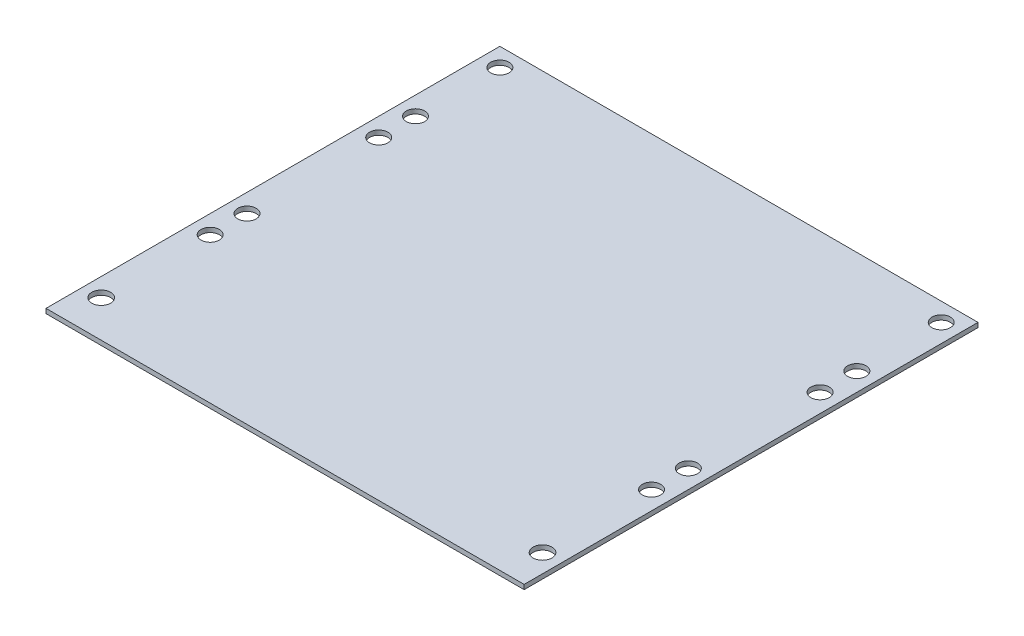
ISO-10303-21;
HEADER;
FILE_DESCRIPTION(('STEP AP214'),'2;1');
FILE_NAME('part.step','',(''),(''),'','','');
FILE_SCHEMA(('AUTOMOTIVE_DESIGN { 1 0 10303 214 1 1 1 1 }'));
ENDSEC;
DATA;
#1=APPLICATION_CONTEXT('core data for automotive mechanical design processes');
#2=APPLICATION_PROTOCOL_DEFINITION('international standard','automotive_design',2000,#1);
#3=PRODUCT_CONTEXT('',#1,'mechanical');
#4=PRODUCT('Part','Part','',(#3));
#5=PRODUCT_RELATED_PRODUCT_CATEGORY('part','',(#4));
#6=PRODUCT_DEFINITION_FORMATION('','',#4);
#7=PRODUCT_DEFINITION_CONTEXT('part definition',#1,'design');
#8=PRODUCT_DEFINITION('design','',#6,#7);
#9=PRODUCT_DEFINITION_SHAPE('','',#8);
#10=(LENGTH_UNIT() NAMED_UNIT(*) SI_UNIT(.MILLI.,.METRE.));
#11=(NAMED_UNIT(*) PLANE_ANGLE_UNIT() SI_UNIT($,.RADIAN.));
#12=(NAMED_UNIT(*) SI_UNIT($,.STERADIAN.) SOLID_ANGLE_UNIT());
#13=UNCERTAINTY_MEASURE_WITH_UNIT(LENGTH_MEASURE(1.E-05),#10,'distance_accuracy_value','');
#14=(GEOMETRIC_REPRESENTATION_CONTEXT(3) GLOBAL_UNCERTAINTY_ASSIGNED_CONTEXT((#13)) GLOBAL_UNIT_ASSIGNED_CONTEXT((#10,
#11,#12)) REPRESENTATION_CONTEXT('',''));
#15=CARTESIAN_POINT('',(0.,0.,0.));
#16=DIRECTION('',(0.,0.,1.));
#17=DIRECTION('',(1.,0.,0.));
#18=AXIS2_PLACEMENT_3D('',#15,#16,#17);
#19=CARTESIAN_POINT('',(0.,1.5875,0.));
#20=DIRECTION('',(0.,-1.,0.));
#21=DIRECTION('',(0.,0.,-1.));
#22=AXIS2_PLACEMENT_3D('',#19,#20,#21);
#23=PLANE('',#22);
#24=DIRECTION('',(0.,0.,1.));
#25=VECTOR('',#24,1.);
#26=CARTESIAN_POINT('',(0.,1.5875,0.));
#27=LINE('',#26,#25);
#28=CARTESIAN_POINT('',(0.,1.5875,-156.718));
#29=VERTEX_POINT('',#28);
#30=CARTESIAN_POINT('',(0.,1.5875,0.));
#31=VERTEX_POINT('',#30);
#32=EDGE_CURVE('E92',#29,#31,#27,.T.);
#33=ORIENTED_EDGE('',*,*,#32,.T.);
#34=DIRECTION('',(1.,0.,0.));
#35=VECTOR('',#34,1.);
#36=CARTESIAN_POINT('',(0.,1.5875,0.));
#37=LINE('',#36,#35);
#38=CARTESIAN_POINT('',(165.1,1.5875,0.));
#39=VERTEX_POINT('',#38);
#40=EDGE_CURVE('E87',#31,#39,#37,.T.);
#41=ORIENTED_EDGE('',*,*,#40,.T.);
#42=DIRECTION('',(0.,0.,-1.));
#43=VECTOR('',#42,1.);
#44=CARTESIAN_POINT('',(165.1,1.5875,0.));
#45=LINE('',#44,#43);
#46=CARTESIAN_POINT('',(165.1,1.5875,-156.718));
#47=VERTEX_POINT('',#46);
#48=EDGE_CURVE('E90',#39,#47,#45,.T.);
#49=ORIENTED_EDGE('',*,*,#48,.T.);
#50=DIRECTION('',(-1.,0.,0.));
#51=VECTOR('',#50,1.);
#52=CARTESIAN_POINT('',(0.,1.5875,-156.718));
#53=LINE('',#52,#51);
#54=EDGE_CURVE('E57',#47,#29,#53,.T.);
#55=ORIENTED_EDGE('',*,*,#54,.T.);
#56=EDGE_LOOP('',(#33,#41,#49,#55));
#57=FACE_BOUND('',#56,.T.);
#58=CARTESIAN_POINT('',(6.35,1.5875,-12.7));
#59=DIRECTION('',(0.,1.,0.));
#60=DIRECTION('',(0.,0.,1.));
#61=AXIS2_PLACEMENT_3D('',#58,#59,#60);
#62=CIRCLE('',#61,3.2639);
#63=CARTESIAN_POINT('',(6.35,1.5875,-9.4361));
#64=VERTEX_POINT('',#63);
#65=EDGE_CURVE('E112',#64,#64,#62,.T.);
#66=ORIENTED_EDGE('',*,*,#65,.F.);
#67=EDGE_LOOP('',(#66));
#68=FACE_BOUND('',#67,.T.);
#69=CARTESIAN_POINT('',(6.35,1.5875,-121.2365567009));
#70=DIRECTION('',(0.,1.,0.));
#71=DIRECTION('',(0.,0.,1.));
#72=AXIS2_PLACEMENT_3D('',#69,#70,#71);
#73=CIRCLE('',#72,3.175);
#74=CARTESIAN_POINT('',(6.35,1.5875,-118.0615567009));
#75=VERTEX_POINT('',#74);
#76=EDGE_CURVE('E134',#75,#75,#73,.T.);
#77=ORIENTED_EDGE('',*,*,#76,.F.);
#78=EDGE_LOOP('',(#77));
#79=FACE_BOUND('',#78,.T.);
#80=CARTESIAN_POINT('',(6.35,1.5875,-108.5365567009));
#81=DIRECTION('',(0.,1.,0.));
#82=DIRECTION('',(0.,0.,1.));
#83=AXIS2_PLACEMENT_3D('',#80,#81,#82);
#84=CIRCLE('',#83,3.175);
#85=CARTESIAN_POINT('',(6.35,1.5875,-105.3615567009));
#86=VERTEX_POINT('',#85);
#87=EDGE_CURVE('E142',#86,#86,#84,.T.);
#88=ORIENTED_EDGE('',*,*,#87,.F.);
#89=EDGE_LOOP('',(#88));
#90=FACE_BOUND('',#89,.T.);
#91=CARTESIAN_POINT('',(6.35,1.5875,-63.046989690376));
#92=DIRECTION('',(0.,1.,0.));
#93=DIRECTION('',(0.,0.,1.));
#94=AXIS2_PLACEMENT_3D('',#91,#92,#93);
#95=CIRCLE('',#94,3.175);
#96=CARTESIAN_POINT('',(6.35,1.5875,-59.871989690376));
#97=VERTEX_POINT('',#96);
#98=EDGE_CURVE('E150',#97,#97,#95,.T.);
#99=ORIENTED_EDGE('',*,*,#98,.F.);
#100=EDGE_LOOP('',(#99));
#101=FACE_BOUND('',#100,.T.);
#102=CARTESIAN_POINT('',(6.35,1.5875,-150.368));
#103=DIRECTION('',(0.,1.,0.));
#104=DIRECTION('',(0.,0.,1.));
#105=AXIS2_PLACEMENT_3D('',#102,#103,#104);
#106=CIRCLE('',#105,3.175);
#107=CARTESIAN_POINT('',(6.35,1.5875,-147.193));
#108=VERTEX_POINT('',#107);
#109=EDGE_CURVE('E158',#108,#108,#106,.T.);
#110=ORIENTED_EDGE('',*,*,#109,.F.);
#111=EDGE_LOOP('',(#110));
#112=FACE_BOUND('',#111,.T.);
#113=CARTESIAN_POINT('',(158.75,1.5875,-12.7));
#114=DIRECTION('',(0.,1.,0.));
#115=DIRECTION('',(0.,0.,-1.));
#116=AXIS2_PLACEMENT_3D('',#113,#114,#115);
#117=CIRCLE('',#116,3.26390000000001);
#118=CARTESIAN_POINT('',(158.75,1.5875,-15.9639));
#119=VERTEX_POINT('',#118);
#120=EDGE_CURVE('E166',#119,#119,#117,.T.);
#121=ORIENTED_EDGE('',*,*,#120,.F.);
#122=EDGE_LOOP('',(#121));
#123=FACE_BOUND('',#122,.T.);
#124=CARTESIAN_POINT('',(6.35,1.5875,-50.346989690376));
#125=DIRECTION('',(0.,1.,0.));
#126=DIRECTION('',(0.,0.,1.));
#127=AXIS2_PLACEMENT_3D('',#124,#125,#126);
#128=CIRCLE('',#127,3.175);
#129=CARTESIAN_POINT('',(6.35,1.5875,-47.171989690376));
#130=VERTEX_POINT('',#129);
#131=EDGE_CURVE('E174',#130,#130,#128,.T.);
#132=ORIENTED_EDGE('',*,*,#131,.F.);
#133=EDGE_LOOP('',(#132));
#134=FACE_BOUND('',#133,.T.);
#135=CARTESIAN_POINT('',(158.75,1.5875,-50.346989690376));
#136=DIRECTION('',(0.,1.,0.));
#137=DIRECTION('',(0.,0.,-1.));
#138=AXIS2_PLACEMENT_3D('',#135,#136,#137);
#139=CIRCLE('',#138,3.17500000000002);
#140=CARTESIAN_POINT('',(158.75,1.5875,-53.5219896903761));
#141=VERTEX_POINT('',#140);
#142=EDGE_CURVE('E182',#141,#141,#139,.T.);
#143=ORIENTED_EDGE('',*,*,#142,.F.);
#144=EDGE_LOOP('',(#143));
#145=FACE_BOUND('',#144,.T.);
#146=CARTESIAN_POINT('',(158.75,1.5875,-150.368));
#147=DIRECTION('',(0.,1.,0.));
#148=DIRECTION('',(0.,0.,-1.));
#149=AXIS2_PLACEMENT_3D('',#146,#147,#148);
#150=CIRCLE('',#149,3.17499999999997);
#151=CARTESIAN_POINT('',(158.75,1.5875,-153.543));
#152=VERTEX_POINT('',#151);
#153=EDGE_CURVE('E190',#152,#152,#150,.T.);
#154=ORIENTED_EDGE('',*,*,#153,.F.);
#155=EDGE_LOOP('',(#154));
#156=FACE_BOUND('',#155,.T.);
#157=CARTESIAN_POINT('',(158.75,1.5875,-63.046989690376));
#158=DIRECTION('',(0.,1.,0.));
#159=DIRECTION('',(0.,0.,-1.));
#160=AXIS2_PLACEMENT_3D('',#157,#158,#159);
#161=CIRCLE('',#160,3.17500000000002);
#162=CARTESIAN_POINT('',(158.75,1.5875,-66.2219896903761));
#163=VERTEX_POINT('',#162);
#164=EDGE_CURVE('E198',#163,#163,#161,.T.);
#165=ORIENTED_EDGE('',*,*,#164,.F.);
#166=EDGE_LOOP('',(#165));
#167=FACE_BOUND('',#166,.T.);
#168=CARTESIAN_POINT('',(158.75,1.5875,-108.5365567009));
#169=DIRECTION('',(0.,1.,0.));
#170=DIRECTION('',(0.,0.,-1.));
#171=AXIS2_PLACEMENT_3D('',#168,#169,#170);
#172=CIRCLE('',#171,3.17500000000002);
#173=CARTESIAN_POINT('',(158.75,1.5875,-111.7115567009));
#174=VERTEX_POINT('',#173);
#175=EDGE_CURVE('E206',#174,#174,#172,.T.);
#176=ORIENTED_EDGE('',*,*,#175,.F.);
#177=EDGE_LOOP('',(#176));
#178=FACE_BOUND('',#177,.T.);
#179=CARTESIAN_POINT('',(158.75,1.5875,-121.2365567009));
#180=DIRECTION('',(0.,1.,0.));
#181=DIRECTION('',(0.,0.,-1.));
#182=AXIS2_PLACEMENT_3D('',#179,#180,#181);
#183=CIRCLE('',#182,3.17500000000002);
#184=CARTESIAN_POINT('',(158.75,1.5875,-124.4115567009));
#185=VERTEX_POINT('',#184);
#186=EDGE_CURVE('E214',#185,#185,#183,.T.);
#187=ORIENTED_EDGE('',*,*,#186,.F.);
#188=EDGE_LOOP('',(#187));
#189=FACE_BOUND('',#188,.T.);
#190=ADVANCED_FACE('F39',(#57,#68,#79,#90,#101,#112,#123,#134,#145,#156,#167,#178,#189),#23,.F.);
#191=CARTESIAN_POINT('',(0.,0.,0.));
#192=DIRECTION('',(0.,-1.,0.));
#193=DIRECTION('',(0.,0.,-1.));
#194=AXIS2_PLACEMENT_3D('',#191,#192,#193);
#195=PLANE('',#194);
#196=CARTESIAN_POINT('',(158.75,0.,-108.5365567009));
#197=DIRECTION('',(0.,1.,0.));
#198=DIRECTION('',(0.,0.,-1.));
#199=AXIS2_PLACEMENT_3D('',#196,#197,#198);
#200=CIRCLE('',#199,3.17500000000002);
#201=CARTESIAN_POINT('',(158.75,0.,-111.7115567009));
#202=VERTEX_POINT('',#201);
#203=EDGE_CURVE('E210',#202,#202,#200,.T.);
#204=ORIENTED_EDGE('',*,*,#203,.T.);
#205=EDGE_LOOP('',(#204));
#206=FACE_BOUND('',#205,.T.);
#207=CARTESIAN_POINT('',(158.75,0.,-150.368));
#208=DIRECTION('',(0.,1.,0.));
#209=DIRECTION('',(0.,0.,-1.));
#210=AXIS2_PLACEMENT_3D('',#207,#208,#209);
#211=CIRCLE('',#210,3.17499999999997);
#212=CARTESIAN_POINT('',(158.75,0.,-153.543));
#213=VERTEX_POINT('',#212);
#214=EDGE_CURVE('E194',#213,#213,#211,.T.);
#215=ORIENTED_EDGE('',*,*,#214,.T.);
#216=EDGE_LOOP('',(#215));
#217=FACE_BOUND('',#216,.T.);
#218=CARTESIAN_POINT('',(6.35,0.,-50.346989690376));
#219=DIRECTION('',(0.,1.,0.));
#220=DIRECTION('',(0.,0.,1.));
#221=AXIS2_PLACEMENT_3D('',#218,#219,#220);
#222=CIRCLE('',#221,3.175);
#223=CARTESIAN_POINT('',(6.35,0.,-47.171989690376));
#224=VERTEX_POINT('',#223);
#225=EDGE_CURVE('E178',#224,#224,#222,.T.);
#226=ORIENTED_EDGE('',*,*,#225,.T.);
#227=EDGE_LOOP('',(#226));
#228=FACE_BOUND('',#227,.T.);
#229=CARTESIAN_POINT('',(6.35,0.,-150.368));
#230=DIRECTION('',(0.,1.,0.));
#231=DIRECTION('',(0.,0.,1.));
#232=AXIS2_PLACEMENT_3D('',#229,#230,#231);
#233=CIRCLE('',#232,3.175);
#234=CARTESIAN_POINT('',(6.35,0.,-147.193));
#235=VERTEX_POINT('',#234);
#236=EDGE_CURVE('E162',#235,#235,#233,.T.);
#237=ORIENTED_EDGE('',*,*,#236,.T.);
#238=EDGE_LOOP('',(#237));
#239=FACE_BOUND('',#238,.T.);
#240=CARTESIAN_POINT('',(6.35,0.,-108.5365567009));
#241=DIRECTION('',(0.,1.,0.));
#242=DIRECTION('',(0.,0.,1.));
#243=AXIS2_PLACEMENT_3D('',#240,#241,#242);
#244=CIRCLE('',#243,3.175);
#245=CARTESIAN_POINT('',(6.35,0.,-105.3615567009));
#246=VERTEX_POINT('',#245);
#247=EDGE_CURVE('E146',#246,#246,#244,.T.);
#248=ORIENTED_EDGE('',*,*,#247,.T.);
#249=EDGE_LOOP('',(#248));
#250=FACE_BOUND('',#249,.T.);
#251=CARTESIAN_POINT('',(6.35,0.,-12.7));
#252=DIRECTION('',(0.,1.,0.));
#253=DIRECTION('',(0.,0.,1.));
#254=AXIS2_PLACEMENT_3D('',#251,#252,#253);
#255=CIRCLE('',#254,3.2639);
#256=CARTESIAN_POINT('',(6.35,0.,-9.4361));
#257=VERTEX_POINT('',#256);
#258=EDGE_CURVE('E130',#257,#257,#255,.T.);
#259=ORIENTED_EDGE('',*,*,#258,.T.);
#260=EDGE_LOOP('',(#259));
#261=FACE_BOUND('',#260,.T.);
#262=DIRECTION('',(0.,0.,1.));
#263=VECTOR('',#262,1.);
#264=CARTESIAN_POINT('',(0.,0.,0.));
#265=LINE('',#264,#263);
#266=CARTESIAN_POINT('',(0.,0.,-156.718));
#267=VERTEX_POINT('',#266);
#268=CARTESIAN_POINT('',(0.,0.,0.));
#269=VERTEX_POINT('',#268);
#270=EDGE_CURVE('E108',#267,#269,#265,.T.);
#271=ORIENTED_EDGE('',*,*,#270,.F.);
#272=DIRECTION('',(-1.,0.,0.));
#273=VECTOR('',#272,1.);
#274=CARTESIAN_POINT('',(0.,0.,-156.718));
#275=LINE('',#274,#273);
#276=CARTESIAN_POINT('',(165.1,0.,-156.718));
#277=VERTEX_POINT('',#276);
#278=EDGE_CURVE('E80',#277,#267,#275,.T.);
#279=ORIENTED_EDGE('',*,*,#278,.F.);
#280=DIRECTION('',(0.,0.,-1.));
#281=VECTOR('',#280,1.);
#282=CARTESIAN_POINT('',(165.1,0.,0.));
#283=LINE('',#282,#281);
#284=CARTESIAN_POINT('',(165.1,0.,0.));
#285=VERTEX_POINT('',#284);
#286=EDGE_CURVE('E74',#285,#277,#283,.T.);
#287=ORIENTED_EDGE('',*,*,#286,.F.);
#288=DIRECTION('',(1.,0.,0.));
#289=VECTOR('',#288,1.);
#290=CARTESIAN_POINT('',(0.,0.,0.));
#291=LINE('',#290,#289);
#292=EDGE_CURVE('E97',#269,#285,#291,.T.);
#293=ORIENTED_EDGE('',*,*,#292,.F.);
#294=EDGE_LOOP('',(#271,#279,#287,#293));
#295=FACE_BOUND('',#294,.T.);
#296=CARTESIAN_POINT('',(6.35,0.,-121.2365567009));
#297=DIRECTION('',(0.,1.,0.));
#298=DIRECTION('',(0.,0.,1.));
#299=AXIS2_PLACEMENT_3D('',#296,#297,#298);
#300=CIRCLE('',#299,3.175);
#301=CARTESIAN_POINT('',(6.35,0.,-118.0615567009));
#302=VERTEX_POINT('',#301);
#303=EDGE_CURVE('E138',#302,#302,#300,.T.);
#304=ORIENTED_EDGE('',*,*,#303,.T.);
#305=EDGE_LOOP('',(#304));
#306=FACE_BOUND('',#305,.T.);
#307=CARTESIAN_POINT('',(6.35,0.,-63.046989690376));
#308=DIRECTION('',(0.,1.,0.));
#309=DIRECTION('',(0.,0.,1.));
#310=AXIS2_PLACEMENT_3D('',#307,#308,#309);
#311=CIRCLE('',#310,3.175);
#312=CARTESIAN_POINT('',(6.35,0.,-59.871989690376));
#313=VERTEX_POINT('',#312);
#314=EDGE_CURVE('E154',#313,#313,#311,.T.);
#315=ORIENTED_EDGE('',*,*,#314,.T.);
#316=EDGE_LOOP('',(#315));
#317=FACE_BOUND('',#316,.T.);
#318=CARTESIAN_POINT('',(158.75,0.,-12.7));
#319=DIRECTION('',(0.,1.,0.));
#320=DIRECTION('',(0.,0.,-1.));
#321=AXIS2_PLACEMENT_3D('',#318,#319,#320);
#322=CIRCLE('',#321,3.26390000000001);
#323=CARTESIAN_POINT('',(158.75,0.,-15.9639));
#324=VERTEX_POINT('',#323);
#325=EDGE_CURVE('E170',#324,#324,#322,.T.);
#326=ORIENTED_EDGE('',*,*,#325,.T.);
#327=EDGE_LOOP('',(#326));
#328=FACE_BOUND('',#327,.T.);
#329=CARTESIAN_POINT('',(158.75,0.,-50.346989690376));
#330=DIRECTION('',(0.,1.,0.));
#331=DIRECTION('',(0.,0.,-1.));
#332=AXIS2_PLACEMENT_3D('',#329,#330,#331);
#333=CIRCLE('',#332,3.17500000000002);
#334=CARTESIAN_POINT('',(158.75,0.,-53.5219896903761));
#335=VERTEX_POINT('',#334);
#336=EDGE_CURVE('E186',#335,#335,#333,.T.);
#337=ORIENTED_EDGE('',*,*,#336,.T.);
#338=EDGE_LOOP('',(#337));
#339=FACE_BOUND('',#338,.T.);
#340=CARTESIAN_POINT('',(158.75,0.,-63.046989690376));
#341=DIRECTION('',(0.,1.,0.));
#342=DIRECTION('',(0.,0.,-1.));
#343=AXIS2_PLACEMENT_3D('',#340,#341,#342);
#344=CIRCLE('',#343,3.17500000000002);
#345=CARTESIAN_POINT('',(158.75,0.,-66.2219896903761));
#346=VERTEX_POINT('',#345);
#347=EDGE_CURVE('E202',#346,#346,#344,.T.);
#348=ORIENTED_EDGE('',*,*,#347,.T.);
#349=EDGE_LOOP('',(#348));
#350=FACE_BOUND('',#349,.T.);
#351=CARTESIAN_POINT('',(158.75,0.,-121.2365567009));
#352=DIRECTION('',(0.,1.,0.));
#353=DIRECTION('',(0.,0.,-1.));
#354=AXIS2_PLACEMENT_3D('',#351,#352,#353);
#355=CIRCLE('',#354,3.17500000000002);
#356=CARTESIAN_POINT('',(158.75,0.,-124.4115567009));
#357=VERTEX_POINT('',#356);
#358=EDGE_CURVE('E218',#357,#357,#355,.T.);
#359=ORIENTED_EDGE('',*,*,#358,.T.);
#360=EDGE_LOOP('',(#359));
#361=FACE_BOUND('',#360,.T.);
#362=ADVANCED_FACE('F125',(#206,#217,#228,#239,#250,#261,#295,#306,#317,#328,#339,#350,#361),
#195,.T.);
#363=CARTESIAN_POINT('',(0.,1.5875,0.));
#364=DIRECTION('',(1.,0.,0.));
#365=DIRECTION('',(0.,0.,-1.));
#366=AXIS2_PLACEMENT_3D('',#363,#364,#365);
#367=PLANE('',#366);
#368=ORIENTED_EDGE('',*,*,#270,.T.);
#369=DIRECTION('',(0.,-1.,0.));
#370=VECTOR('',#369,1.);
#371=CARTESIAN_POINT('',(0.,1.5875,0.));
#372=LINE('',#371,#370);
#373=EDGE_CURVE('E11',#31,#269,#372,.T.);
#374=ORIENTED_EDGE('',*,*,#373,.F.);
#375=ORIENTED_EDGE('',*,*,#32,.F.);
#376=DIRECTION('',(0.,-1.,0.));
#377=VECTOR('',#376,1.);
#378=CARTESIAN_POINT('',(0.,1.5875,-156.718));
#379=LINE('',#378,#377);
#380=EDGE_CURVE('E104',#29,#267,#379,.T.);
#381=ORIENTED_EDGE('',*,*,#380,.T.);
#382=EDGE_LOOP('',(#368,#374,#375,#381));
#383=FACE_BOUND('',#382,.T.);
#384=ADVANCED_FACE('F41',(#383),#367,.F.);
#385=CARTESIAN_POINT('',(0.,1.5875,0.));
#386=DIRECTION('',(0.,0.,-1.));
#387=DIRECTION('',(-1.,0.,0.));
#388=AXIS2_PLACEMENT_3D('',#385,#386,#387);
#389=PLANE('',#388);
#390=ORIENTED_EDGE('',*,*,#292,.T.);
#391=DIRECTION('',(0.,-1.,0.));
#392=VECTOR('',#391,1.);
#393=CARTESIAN_POINT('',(165.1,1.5875,0.));
#394=LINE('',#393,#392);
#395=EDGE_CURVE('E49',#39,#285,#394,.T.);
#396=ORIENTED_EDGE('',*,*,#395,.F.);
#397=ORIENTED_EDGE('',*,*,#40,.F.);
#398=ORIENTED_EDGE('',*,*,#373,.T.);
#399=EDGE_LOOP('',(#390,#396,#397,#398));
#400=FACE_BOUND('',#399,.T.);
#401=ADVANCED_FACE('F96',(#400),#389,.F.);
#402=CARTESIAN_POINT('',(165.1,1.5875,0.));
#403=DIRECTION('',(-1.,0.,0.));
#404=DIRECTION('',(0.,0.,1.));
#405=AXIS2_PLACEMENT_3D('',#402,#403,#404);
#406=PLANE('',#405);
#407=ORIENTED_EDGE('',*,*,#286,.T.);
#408=DIRECTION('',(0.,-1.,0.));
#409=VECTOR('',#408,1.);
#410=CARTESIAN_POINT('',(165.1,1.5875,-156.718));
#411=LINE('',#410,#409);
#412=EDGE_CURVE('E99',#47,#277,#411,.T.);
#413=ORIENTED_EDGE('',*,*,#412,.F.);
#414=ORIENTED_EDGE('',*,*,#48,.F.);
#415=ORIENTED_EDGE('',*,*,#395,.T.);
#416=EDGE_LOOP('',(#407,#413,#414,#415));
#417=FACE_BOUND('',#416,.T.);
#418=ADVANCED_FACE('F100',(#417),#406,.F.);
#419=CARTESIAN_POINT('',(0.,1.5875,-156.718));
#420=DIRECTION('',(0.,0.,1.));
#421=DIRECTION('',(1.,0.,0.));
#422=AXIS2_PLACEMENT_3D('',#419,#420,#421);
#423=PLANE('',#422);
#424=ORIENTED_EDGE('',*,*,#278,.T.);
#425=ORIENTED_EDGE('',*,*,#380,.F.);
#426=ORIENTED_EDGE('',*,*,#54,.F.);
#427=ORIENTED_EDGE('',*,*,#412,.T.);
#428=EDGE_LOOP('',(#424,#425,#426,#427));
#429=FACE_BOUND('',#428,.T.);
#430=ADVANCED_FACE('F122',(#429),#423,.F.);
#431=CARTESIAN_POINT('',(6.35,1.5875,-12.7));
#432=DIRECTION('',(0.,-1.,0.));
#433=DIRECTION('',(0.,0.,-1.));
#434=AXIS2_PLACEMENT_3D('',#431,#432,#433);
#435=CYLINDRICAL_SURFACE('',#434,3.2639);
#436=ORIENTED_EDGE('',*,*,#65,.T.);
#437=EDGE_LOOP('',(#436));
#438=FACE_BOUND('',#437,.T.);
#439=ORIENTED_EDGE('',*,*,#258,.F.);
#440=EDGE_LOOP('',(#439));
#441=FACE_BOUND('',#440,.T.);
#442=ADVANCED_FACE('F237',(#438,#441),#435,.F.);
#443=CARTESIAN_POINT('',(6.35,1.5875,-121.2365567009));
#444=DIRECTION('',(0.,-1.,0.));
#445=DIRECTION('',(0.,0.,-1.));
#446=AXIS2_PLACEMENT_3D('',#443,#444,#445);
#447=CYLINDRICAL_SURFACE('',#446,3.175);
#448=ORIENTED_EDGE('',*,*,#76,.T.);
#449=EDGE_LOOP('',(#448));
#450=FACE_BOUND('',#449,.T.);
#451=ORIENTED_EDGE('',*,*,#303,.F.);
#452=EDGE_LOOP('',(#451));
#453=FACE_BOUND('',#452,.T.);
#454=ADVANCED_FACE('F283',(#450,#453),#447,.F.);
#455=CARTESIAN_POINT('',(6.35,1.5875,-108.5365567009));
#456=DIRECTION('',(0.,-1.,0.));
#457=DIRECTION('',(0.,0.,-1.));
#458=AXIS2_PLACEMENT_3D('',#455,#456,#457);
#459=CYLINDRICAL_SURFACE('',#458,3.175);
#460=ORIENTED_EDGE('',*,*,#87,.T.);
#461=EDGE_LOOP('',(#460));
#462=FACE_BOUND('',#461,.T.);
#463=ORIENTED_EDGE('',*,*,#247,.F.);
#464=EDGE_LOOP('',(#463));
#465=FACE_BOUND('',#464,.T.);
#466=ADVANCED_FACE('F291',(#462,#465),#459,.F.);
#467=CARTESIAN_POINT('',(6.35,1.5875,-63.046989690376));
#468=DIRECTION('',(0.,-1.,0.));
#469=DIRECTION('',(0.,0.,-1.));
#470=AXIS2_PLACEMENT_3D('',#467,#468,#469);
#471=CYLINDRICAL_SURFACE('',#470,3.175);
#472=ORIENTED_EDGE('',*,*,#98,.T.);
#473=EDGE_LOOP('',(#472));
#474=FACE_BOUND('',#473,.T.);
#475=ORIENTED_EDGE('',*,*,#314,.F.);
#476=EDGE_LOOP('',(#475));
#477=FACE_BOUND('',#476,.T.);
#478=ADVANCED_FACE('F299',(#474,#477),#471,.F.);
#479=CARTESIAN_POINT('',(6.35,1.5875,-150.368));
#480=DIRECTION('',(0.,-1.,0.));
#481=DIRECTION('',(0.,0.,-1.));
#482=AXIS2_PLACEMENT_3D('',#479,#480,#481);
#483=CYLINDRICAL_SURFACE('',#482,3.175);
#484=ORIENTED_EDGE('',*,*,#109,.T.);
#485=EDGE_LOOP('',(#484));
#486=FACE_BOUND('',#485,.T.);
#487=ORIENTED_EDGE('',*,*,#236,.F.);
#488=EDGE_LOOP('',(#487));
#489=FACE_BOUND('',#488,.T.);
#490=ADVANCED_FACE('F308',(#486,#489),#483,.F.);
#491=CARTESIAN_POINT('',(158.75,1.5875,-12.7));
#492=DIRECTION('',(0.,-1.,0.));
#493=DIRECTION('',(0.,0.,-1.));
#494=AXIS2_PLACEMENT_3D('',#491,#492,#493);
#495=CYLINDRICAL_SURFACE('',#494,3.26390000000001);
#496=ORIENTED_EDGE('',*,*,#120,.T.);
#497=EDGE_LOOP('',(#496));
#498=FACE_BOUND('',#497,.T.);
#499=ORIENTED_EDGE('',*,*,#325,.F.);
#500=EDGE_LOOP('',(#499));
#501=FACE_BOUND('',#500,.T.);
#502=ADVANCED_FACE('F317',(#498,#501),#495,.F.);
#503=CARTESIAN_POINT('',(6.35,1.5875,-50.346989690376));
#504=DIRECTION('',(0.,-1.,0.));
#505=DIRECTION('',(0.,0.,-1.));
#506=AXIS2_PLACEMENT_3D('',#503,#504,#505);
#507=CYLINDRICAL_SURFACE('',#506,3.175);
#508=ORIENTED_EDGE('',*,*,#131,.T.);
#509=EDGE_LOOP('',(#508));
#510=FACE_BOUND('',#509,.T.);
#511=ORIENTED_EDGE('',*,*,#225,.F.);
#512=EDGE_LOOP('',(#511));
#513=FACE_BOUND('',#512,.T.);
#514=ADVANCED_FACE('F326',(#510,#513),#507,.F.);
#515=CARTESIAN_POINT('',(158.75,1.5875,-50.346989690376));
#516=DIRECTION('',(0.,-1.,0.));
#517=DIRECTION('',(0.,0.,-1.));
#518=AXIS2_PLACEMENT_3D('',#515,#516,#517);
#519=CYLINDRICAL_SURFACE('',#518,3.17500000000002);
#520=ORIENTED_EDGE('',*,*,#142,.T.);
#521=EDGE_LOOP('',(#520));
#522=FACE_BOUND('',#521,.T.);
#523=ORIENTED_EDGE('',*,*,#336,.F.);
#524=EDGE_LOOP('',(#523));
#525=FACE_BOUND('',#524,.T.);
#526=ADVANCED_FACE('F335',(#522,#525),#519,.F.);
#527=CARTESIAN_POINT('',(158.75,1.5875,-150.368));
#528=DIRECTION('',(0.,-1.,0.));
#529=DIRECTION('',(0.,0.,-1.));
#530=AXIS2_PLACEMENT_3D('',#527,#528,#529);
#531=CYLINDRICAL_SURFACE('',#530,3.17499999999997);
#532=ORIENTED_EDGE('',*,*,#153,.T.);
#533=EDGE_LOOP('',(#532));
#534=FACE_BOUND('',#533,.T.);
#535=ORIENTED_EDGE('',*,*,#214,.F.);
#536=EDGE_LOOP('',(#535));
#537=FACE_BOUND('',#536,.T.);
#538=ADVANCED_FACE('F344',(#534,#537),#531,.F.);
#539=CARTESIAN_POINT('',(158.75,1.5875,-63.046989690376));
#540=DIRECTION('',(0.,-1.,0.));
#541=DIRECTION('',(0.,0.,-1.));
#542=AXIS2_PLACEMENT_3D('',#539,#540,#541);
#543=CYLINDRICAL_SURFACE('',#542,3.17500000000002);
#544=ORIENTED_EDGE('',*,*,#164,.T.);
#545=EDGE_LOOP('',(#544));
#546=FACE_BOUND('',#545,.T.);
#547=ORIENTED_EDGE('',*,*,#347,.F.);
#548=EDGE_LOOP('',(#547));
#549=FACE_BOUND('',#548,.T.);
#550=ADVANCED_FACE('F353',(#546,#549),#543,.F.);
#551=CARTESIAN_POINT('',(158.75,1.5875,-108.5365567009));
#552=DIRECTION('',(0.,-1.,0.));
#553=DIRECTION('',(0.,0.,-1.));
#554=AXIS2_PLACEMENT_3D('',#551,#552,#553);
#555=CYLINDRICAL_SURFACE('',#554,3.17500000000002);
#556=ORIENTED_EDGE('',*,*,#175,.T.);
#557=EDGE_LOOP('',(#556));
#558=FACE_BOUND('',#557,.T.);
#559=ORIENTED_EDGE('',*,*,#203,.F.);
#560=EDGE_LOOP('',(#559));
#561=FACE_BOUND('',#560,.T.);
#562=ADVANCED_FACE('F362',(#558,#561),#555,.F.);
#563=CARTESIAN_POINT('',(158.75,1.5875,-121.2365567009));
#564=DIRECTION('',(0.,-1.,0.));
#565=DIRECTION('',(0.,0.,-1.));
#566=AXIS2_PLACEMENT_3D('',#563,#564,#565);
#567=CYLINDRICAL_SURFACE('',#566,3.17500000000002);
#568=ORIENTED_EDGE('',*,*,#186,.T.);
#569=EDGE_LOOP('',(#568));
#570=FACE_BOUND('',#569,.T.);
#571=ORIENTED_EDGE('',*,*,#358,.F.);
#572=EDGE_LOOP('',(#571));
#573=FACE_BOUND('',#572,.T.);
#574=ADVANCED_FACE('F226',(#570,#573),#567,.F.);
#575=CLOSED_SHELL('',(#190,#362,#384,#401,#418,#430,#442,#454,#466,#478,#490,#502,#514,#526,
#538,#550,#562,#574));
#576=MANIFOLD_SOLID_BREP('B2',#575);
#577=ADVANCED_BREP_SHAPE_REPRESENTATION('',(#18,#576),#14);
#578=SHAPE_DEFINITION_REPRESENTATION(#9,#577);
ENDSEC;
END-ISO-10303-21;
